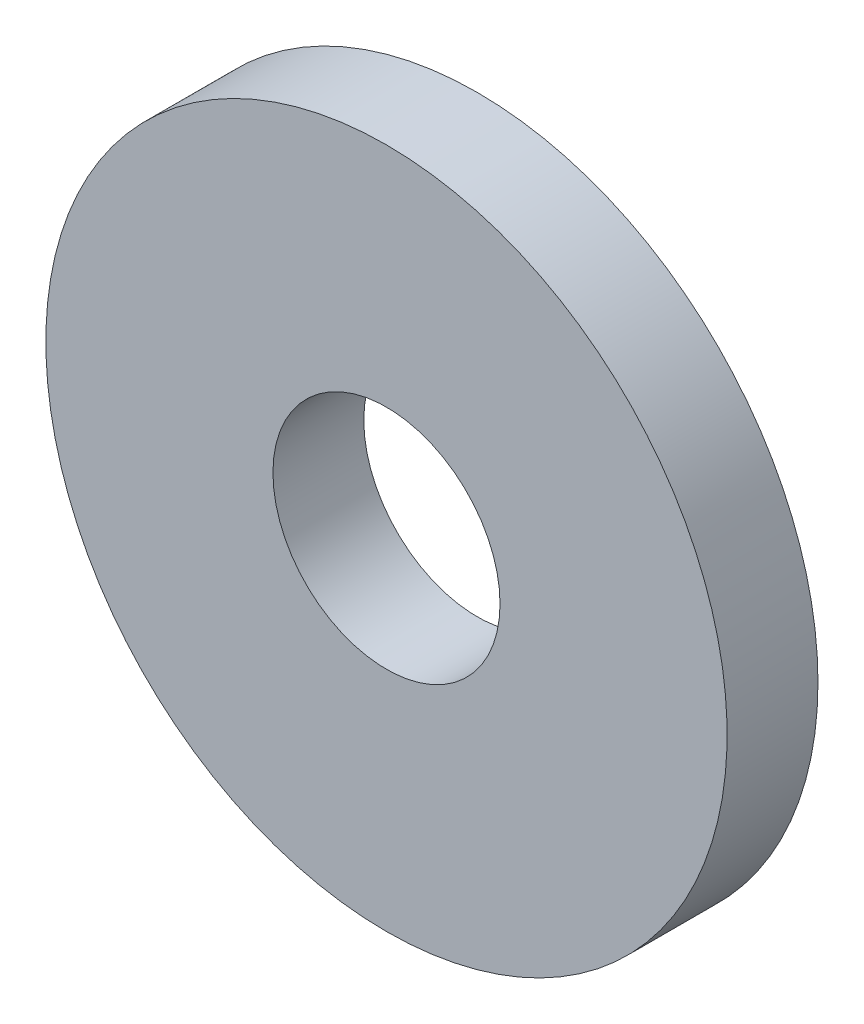
ISO-10303-21;
HEADER;
FILE_DESCRIPTION(('STEP AP214'),'2;1');
FILE_NAME('part.step','',(''),(''),'','','');
FILE_SCHEMA(('AUTOMOTIVE_DESIGN { 1 0 10303 214 1 1 1 1 }'));
ENDSEC;
DATA;
#1=APPLICATION_CONTEXT('core data for automotive mechanical design processes');
#2=APPLICATION_PROTOCOL_DEFINITION('international standard','automotive_design',2000,#1);
#3=PRODUCT_CONTEXT('',#1,'mechanical');
#4=PRODUCT('Part','Part','',(#3));
#5=PRODUCT_RELATED_PRODUCT_CATEGORY('part','',(#4));
#6=PRODUCT_DEFINITION_FORMATION('','',#4);
#7=PRODUCT_DEFINITION_CONTEXT('part definition',#1,'design');
#8=PRODUCT_DEFINITION('design','',#6,#7);
#9=PRODUCT_DEFINITION_SHAPE('','',#8);
#10=(LENGTH_UNIT() NAMED_UNIT(*) SI_UNIT(.MILLI.,.METRE.));
#11=(NAMED_UNIT(*) PLANE_ANGLE_UNIT() SI_UNIT($,.RADIAN.));
#12=(NAMED_UNIT(*) SI_UNIT($,.STERADIAN.) SOLID_ANGLE_UNIT());
#13=UNCERTAINTY_MEASURE_WITH_UNIT(LENGTH_MEASURE(1.E-05),#10,'distance_accuracy_value','');
#14=(GEOMETRIC_REPRESENTATION_CONTEXT(3) GLOBAL_UNCERTAINTY_ASSIGNED_CONTEXT((#13)) GLOBAL_UNIT_ASSIGNED_CONTEXT((#10,
#11,#12)) REPRESENTATION_CONTEXT('',''));
#15=CARTESIAN_POINT('',(0.,0.,0.));
#16=DIRECTION('',(0.,0.,1.));
#17=DIRECTION('',(1.,0.,0.));
#18=AXIS2_PLACEMENT_3D('',#15,#16,#17);
#19=CARTESIAN_POINT('',(0.,0.,0.));
#20=DIRECTION('',(0.,0.,1.));
#21=DIRECTION('',(1.,0.,0.));
#22=AXIS2_PLACEMENT_3D('',#19,#20,#21);
#23=PLANE('',#22);
#24=CARTESIAN_POINT('',(-86.3374717690087,-75.8664106743052,0.));
#25=DIRECTION('',(0.,0.,1.));
#26=DIRECTION('',(1.,0.,0.));
#27=AXIS2_PLACEMENT_3D('',#24,#25,#26);
#28=CIRCLE('',#27,3.175);
#29=CARTESIAN_POINT('',(-83.1624717690087,-75.8664106743052,0.));
#30=VERTEX_POINT('',#29);
#31=EDGE_CURVE('E44',#30,#30,#28,.T.);
#32=ORIENTED_EDGE('',*,*,#31,.T.);
#33=EDGE_LOOP('',(#32));
#34=FACE_BOUND('',#33,.T.);
#35=CARTESIAN_POINT('',(-86.3374717690087,-75.8664106743052,0.));
#36=DIRECTION('',(0.,0.,1.));
#37=DIRECTION('',(1.,0.,0.));
#38=AXIS2_PLACEMENT_3D('',#35,#36,#37);
#39=CIRCLE('',#38,9.52500000000001);
#40=CARTESIAN_POINT('',(-76.8124717690087,-75.8664106743052,0.));
#41=VERTEX_POINT('',#40);
#42=EDGE_CURVE('E40',#41,#41,#39,.T.);
#43=ORIENTED_EDGE('',*,*,#42,.F.);
#44=EDGE_LOOP('',(#43));
#45=FACE_BOUND('',#44,.T.);
#46=ADVANCED_FACE('F33',(#34,#45),#23,.F.);
#47=CARTESIAN_POINT('',(-86.3374717690087,-75.8664106743052,29.4807683632074));
#48=DIRECTION('',(0.,0.,-1.));
#49=DIRECTION('',(-1.,0.,0.));
#50=AXIS2_PLACEMENT_3D('',#47,#48,#49);
#51=CYLINDRICAL_SURFACE('',#50,9.52500000000001);
#52=CARTESIAN_POINT('',(-86.3374717690087,-75.8664106743052,2.53999999999992));
#53=DIRECTION('',(0.,0.,-1.));
#54=DIRECTION('',(0.,1.,0.));
#55=AXIS2_PLACEMENT_3D('',#52,#53,#54);
#56=CIRCLE('',#55,9.52500000000001);
#57=CARTESIAN_POINT('',(-86.3374717690087,-66.3414106743052,2.53999999999993));
#58=VERTEX_POINT('',#57);
#59=EDGE_CURVE('E10',#58,#58,#56,.T.);
#60=ORIENTED_EDGE('',*,*,#59,.T.);
#61=EDGE_LOOP('',(#60));
#62=FACE_BOUND('',#61,.T.);
#63=ORIENTED_EDGE('',*,*,#42,.T.);
#64=EDGE_LOOP('',(#63));
#65=FACE_BOUND('',#64,.T.);
#66=ADVANCED_FACE('F35',(#62,#65),#51,.T.);
#67=CARTESIAN_POINT('',(-150.95103326378,-65.2013166190514,2.53999999999995));
#68=DIRECTION('',(0.,0.,-1.));
#69=DIRECTION('',(0.948028309156811,-0.318185991264981,0.));
#70=AXIS2_PLACEMENT_3D('',#67,#68,#69);
#71=PLANE('',#70);
#72=CARTESIAN_POINT('',(-86.3374717690087,-75.8664106743052,2.53999999999996));
#73=DIRECTION('',(0.,0.,1.));
#74=DIRECTION('',(1.,0.,0.));
#75=AXIS2_PLACEMENT_3D('',#72,#73,#74);
#76=CIRCLE('',#75,3.175);
#77=CARTESIAN_POINT('',(-83.1624717690087,-75.8664106743052,2.53999999999996));
#78=VERTEX_POINT('',#77);
#79=EDGE_CURVE('E48',#78,#78,#76,.T.);
#80=ORIENTED_EDGE('',*,*,#79,.F.);
#81=EDGE_LOOP('',(#80));
#82=FACE_BOUND('',#81,.T.);
#83=ORIENTED_EDGE('',*,*,#59,.F.);
#84=EDGE_LOOP('',(#83));
#85=FACE_BOUND('',#84,.T.);
#86=ADVANCED_FACE('F57',(#82,#85),#71,.F.);
#87=CARTESIAN_POINT('',(-86.3374717690087,-75.8664106743052,-16.51));
#88=DIRECTION('',(0.,0.,1.));
#89=DIRECTION('',(1.,0.,0.));
#90=AXIS2_PLACEMENT_3D('',#87,#88,#89);
#91=CYLINDRICAL_SURFACE('',#90,3.175);
#92=ORIENTED_EDGE('',*,*,#79,.T.);
#93=EDGE_LOOP('',(#92));
#94=FACE_BOUND('',#93,.T.);
#95=ORIENTED_EDGE('',*,*,#31,.F.);
#96=EDGE_LOOP('',(#95));
#97=FACE_BOUND('',#96,.T.);
#98=ADVANCED_FACE('F54',(#94,#97),#91,.F.);
#99=CLOSED_SHELL('',(#46,#66,#86,#98));
#100=MANIFOLD_SOLID_BREP('B2',#99);
#101=ADVANCED_BREP_SHAPE_REPRESENTATION('',(#18,#100),#14);
#102=SHAPE_DEFINITION_REPRESENTATION(#9,#101);
ENDSEC;
END-ISO-10303-21;
